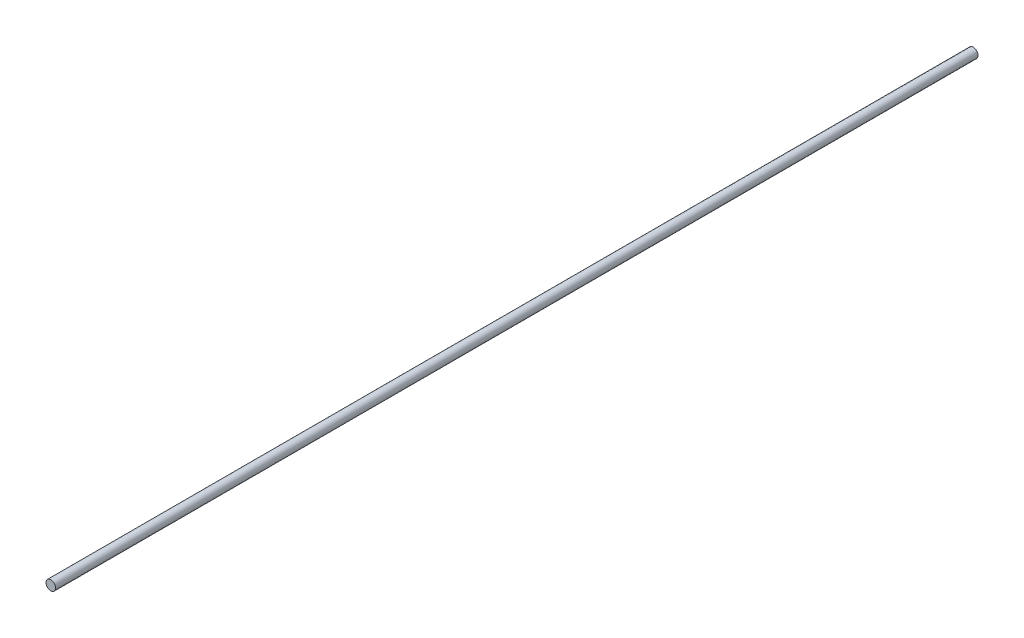
ISO-10303-21;
HEADER;
FILE_DESCRIPTION(('STEP AP214'),'2;1');
FILE_NAME('part.step','',(''),(''),'','','');
FILE_SCHEMA(('AUTOMOTIVE_DESIGN { 1 0 10303 214 1 1 1 1 }'));
ENDSEC;
DATA;
#1=APPLICATION_CONTEXT('core data for automotive mechanical design processes');
#2=APPLICATION_PROTOCOL_DEFINITION('international standard','automotive_design',2000,#1);
#3=PRODUCT_CONTEXT('',#1,'mechanical');
#4=PRODUCT('Part','Part','',(#3));
#5=PRODUCT_RELATED_PRODUCT_CATEGORY('part','',(#4));
#6=PRODUCT_DEFINITION_FORMATION('','',#4);
#7=PRODUCT_DEFINITION_CONTEXT('part definition',#1,'design');
#8=PRODUCT_DEFINITION('design','',#6,#7);
#9=PRODUCT_DEFINITION_SHAPE('','',#8);
#10=(LENGTH_UNIT() NAMED_UNIT(*) SI_UNIT(.MILLI.,.METRE.));
#11=(NAMED_UNIT(*) PLANE_ANGLE_UNIT() SI_UNIT($,.RADIAN.));
#12=(NAMED_UNIT(*) SI_UNIT($,.STERADIAN.) SOLID_ANGLE_UNIT());
#13=UNCERTAINTY_MEASURE_WITH_UNIT(LENGTH_MEASURE(1.E-05),#10,'distance_accuracy_value','');
#14=(GEOMETRIC_REPRESENTATION_CONTEXT(3) GLOBAL_UNCERTAINTY_ASSIGNED_CONTEXT((#13)) GLOBAL_UNIT_ASSIGNED_CONTEXT((#10,
#11,#12)) REPRESENTATION_CONTEXT('',''));
#15=CARTESIAN_POINT('',(0.,0.,0.));
#16=DIRECTION('',(0.,0.,1.));
#17=DIRECTION('',(1.,0.,0.));
#18=AXIS2_PLACEMENT_3D('',#15,#16,#17);
#19=CARTESIAN_POINT('',(0.,0.,1920.));
#20=DIRECTION('',(0.,0.,-1.));
#21=DIRECTION('',(-1.,0.,0.));
#22=AXIS2_PLACEMENT_3D('',#19,#20,#21);
#23=CYLINDRICAL_SURFACE('',#22,10.);
#24=CARTESIAN_POINT('',(0.,0.,1920.));
#25=DIRECTION('',(0.,0.,1.));
#26=DIRECTION('',(1.,0.,0.));
#27=AXIS2_PLACEMENT_3D('',#24,#25,#26);
#28=CIRCLE('',#27,10.);
#29=CARTESIAN_POINT('',(10.,0.,1920.));
#30=VERTEX_POINT('',#29);
#31=EDGE_CURVE('E10',#30,#30,#28,.T.);
#32=ORIENTED_EDGE('',*,*,#31,.F.);
#33=EDGE_LOOP('',(#32));
#34=FACE_BOUND('',#33,.T.);
#35=CARTESIAN_POINT('',(0.,0.,0.));
#36=DIRECTION('',(0.,0.,1.));
#37=DIRECTION('',(1.,0.,0.));
#38=AXIS2_PLACEMENT_3D('',#35,#36,#37);
#39=CIRCLE('',#38,10.);
#40=CARTESIAN_POINT('',(10.,0.,0.));
#41=VERTEX_POINT('',#40);
#42=EDGE_CURVE('E44',#41,#41,#39,.T.);
#43=ORIENTED_EDGE('',*,*,#42,.T.);
#44=EDGE_LOOP('',(#43));
#45=FACE_BOUND('',#44,.T.);
#46=ADVANCED_FACE('F41',(#34,#45),#23,.T.);
#47=CARTESIAN_POINT('',(0.,0.,1920.));
#48=DIRECTION('',(0.,0.,1.));
#49=DIRECTION('',(1.,0.,0.));
#50=AXIS2_PLACEMENT_3D('',#47,#48,#49);
#51=PLANE('',#50);
#52=ORIENTED_EDGE('',*,*,#31,.T.);
#53=EDGE_LOOP('',(#52));
#54=FACE_BOUND('',#53,.T.);
#55=ADVANCED_FACE('F58',(#54),#51,.T.);
#56=CARTESIAN_POINT('',(0.,0.,0.));
#57=DIRECTION('',(0.,0.,1.));
#58=DIRECTION('',(1.,0.,0.));
#59=AXIS2_PLACEMENT_3D('',#56,#57,#58);
#60=PLANE('',#59);
#61=ORIENTED_EDGE('',*,*,#42,.F.);
#62=EDGE_LOOP('',(#61));
#63=FACE_BOUND('',#62,.T.);
#64=ADVANCED_FACE('F56',(#63),#60,.F.);
#65=CLOSED_SHELL('',(#46,#55,#64));
#66=MANIFOLD_SOLID_BREP('B2',#65);
#67=ADVANCED_BREP_SHAPE_REPRESENTATION('',(#18,#66),#14);
#68=SHAPE_DEFINITION_REPRESENTATION(#9,#67);
ENDSEC;
END-ISO-10303-21;
